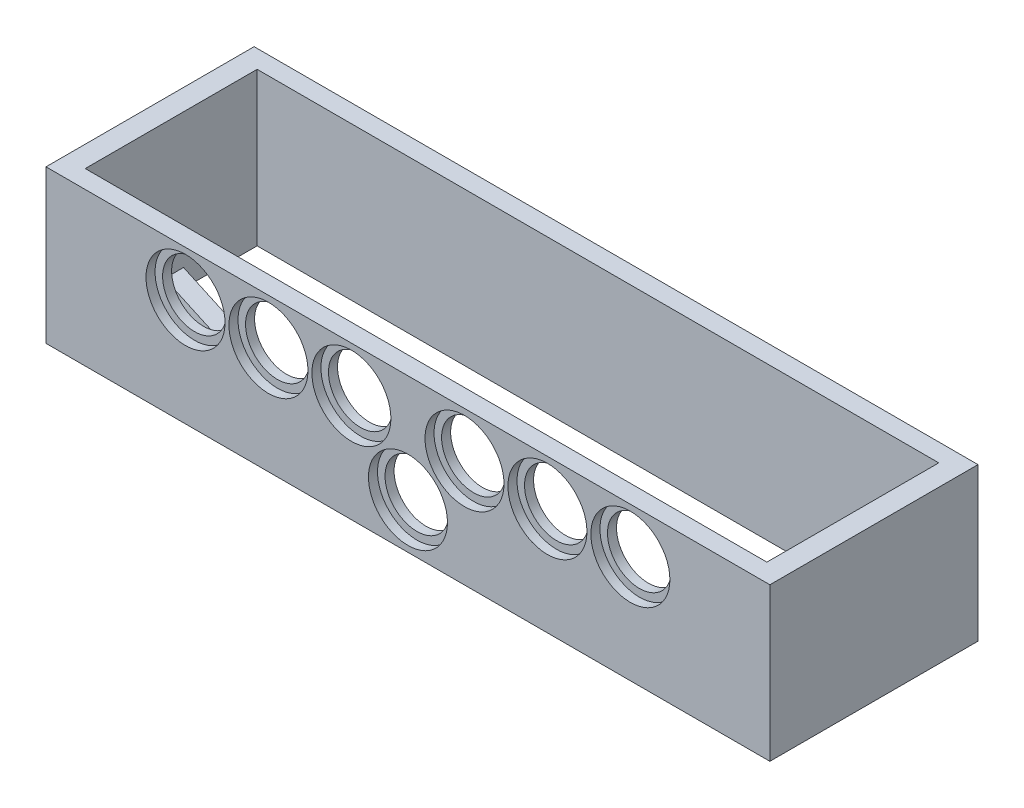
ISO-10303-21;
HEADER;
FILE_DESCRIPTION(('STEP AP214'),'2;1');
FILE_NAME('part.step','',(''),(''),'','','');
FILE_SCHEMA(('AUTOMOTIVE_DESIGN { 1 0 10303 214 1 1 1 1 }'));
ENDSEC;
DATA;
#1=APPLICATION_CONTEXT('core data for automotive mechanical design processes');
#2=APPLICATION_PROTOCOL_DEFINITION('international standard','automotive_design',2000,#1);
#3=PRODUCT_CONTEXT('',#1,'mechanical');
#4=PRODUCT('Part','Part','',(#3));
#5=PRODUCT_RELATED_PRODUCT_CATEGORY('part','',(#4));
#6=PRODUCT_DEFINITION_FORMATION('','',#4);
#7=PRODUCT_DEFINITION_CONTEXT('part definition',#1,'design');
#8=PRODUCT_DEFINITION('design','',#6,#7);
#9=PRODUCT_DEFINITION_SHAPE('','',#8);
#10=(LENGTH_UNIT() NAMED_UNIT(*) SI_UNIT(.MILLI.,.METRE.));
#11=(NAMED_UNIT(*) PLANE_ANGLE_UNIT() SI_UNIT($,.RADIAN.));
#12=(NAMED_UNIT(*) SI_UNIT($,.STERADIAN.) SOLID_ANGLE_UNIT());
#13=UNCERTAINTY_MEASURE_WITH_UNIT(LENGTH_MEASURE(1.E-05),#10,'distance_accuracy_value','');
#14=(GEOMETRIC_REPRESENTATION_CONTEXT(3) GLOBAL_UNCERTAINTY_ASSIGNED_CONTEXT((#13)) GLOBAL_UNIT_ASSIGNED_CONTEXT((#10,
#11,#12)) REPRESENTATION_CONTEXT('',''));
#15=CARTESIAN_POINT('',(0.,0.,0.));
#16=DIRECTION('',(0.,0.,1.));
#17=DIRECTION('',(1.,0.,0.));
#18=AXIS2_PLACEMENT_3D('',#15,#16,#17);
#19=CARTESIAN_POINT('',(7.00000000000001,50.7,-6.));
#20=DIRECTION('',(0.,0.,-1.));
#21=DIRECTION('',(-1.,0.,0.));
#22=AXIS2_PLACEMENT_3D('',#19,#20,#21);
#23=PLANE('',#22);
#24=CARTESIAN_POINT('',(46.25,35.6,-6.));
#25=DIRECTION('',(0.,0.,1.));
#26=DIRECTION('',(1.,0.,0.));
#27=AXIS2_PLACEMENT_3D('',#24,#25,#26);
#28=CIRCLE('',#27,10.6);
#29=CARTESIAN_POINT('',(56.85,35.6,-6.));
#30=VERTEX_POINT('',#29);
#31=EDGE_CURVE('E212',#30,#30,#28,.T.);
#32=ORIENTED_EDGE('',*,*,#31,.T.);
#33=EDGE_LOOP('',(#32));
#34=FACE_BOUND('',#33,.T.);
#35=CARTESIAN_POINT('',(101.25,35.6,-6.));
#36=DIRECTION('',(0.,0.,1.));
#37=DIRECTION('',(1.,0.,0.));
#38=AXIS2_PLACEMENT_3D('',#35,#36,#37);
#39=CIRCLE('',#38,10.6);
#40=CARTESIAN_POINT('',(111.85,35.6,-6.));
#41=VERTEX_POINT('',#40);
#42=EDGE_CURVE('E220',#41,#41,#39,.T.);
#43=ORIENTED_EDGE('',*,*,#42,.T.);
#44=EDGE_LOOP('',(#43));
#45=FACE_BOUND('',#44,.T.);
#46=CARTESIAN_POINT('',(120.,15.1,-6.));
#47=DIRECTION('',(0.,0.,1.));
#48=DIRECTION('',(1.,0.,0.));
#49=AXIS2_PLACEMENT_3D('',#46,#47,#48);
#50=CIRCLE('',#49,10.6);
#51=CARTESIAN_POINT('',(130.6,15.1,-6.));
#52=VERTEX_POINT('',#51);
#53=EDGE_CURVE('E217',#52,#52,#50,.T.);
#54=ORIENTED_EDGE('',*,*,#53,.T.);
#55=EDGE_LOOP('',(#54));
#56=FACE_BOUND('',#55,.T.);
#57=CARTESIAN_POINT('',(138.75,35.6,-6.));
#58=DIRECTION('',(0.,0.,1.));
#59=DIRECTION('',(1.,0.,0.));
#60=AXIS2_PLACEMENT_3D('',#57,#58,#59);
#61=CIRCLE('',#60,10.6);
#62=CARTESIAN_POINT('',(149.35,35.6,-6.));
#63=VERTEX_POINT('',#62);
#64=EDGE_CURVE('E224',#63,#63,#61,.T.);
#65=ORIENTED_EDGE('',*,*,#64,.T.);
#66=EDGE_LOOP('',(#65));
#67=FACE_BOUND('',#66,.T.);
#68=CARTESIAN_POINT('',(73.75,35.6,-6.));
#69=DIRECTION('',(0.,0.,1.));
#70=DIRECTION('',(1.,0.,0.));
#71=AXIS2_PLACEMENT_3D('',#68,#69,#70);
#72=CIRCLE('',#71,10.6);
#73=CARTESIAN_POINT('',(84.35,35.6,-6.));
#74=VERTEX_POINT('',#73);
#75=EDGE_CURVE('E216',#74,#74,#72,.T.);
#76=ORIENTED_EDGE('',*,*,#75,.T.);
#77=EDGE_LOOP('',(#76));
#78=FACE_BOUND('',#77,.T.);
#79=CARTESIAN_POINT('',(166.25,35.6,-6.));
#80=DIRECTION('',(0.,0.,1.));
#81=DIRECTION('',(1.,0.,0.));
#82=AXIS2_PLACEMENT_3D('',#79,#80,#81);
#83=CIRCLE('',#82,10.6);
#84=CARTESIAN_POINT('',(176.85,35.6,-6.));
#85=VERTEX_POINT('',#84);
#86=EDGE_CURVE('E221',#85,#85,#83,.T.);
#87=ORIENTED_EDGE('',*,*,#86,.T.);
#88=EDGE_LOOP('',(#87));
#89=FACE_BOUND('',#88,.T.);
#90=CARTESIAN_POINT('',(193.75,35.6,-6.));
#91=DIRECTION('',(0.,0.,1.));
#92=DIRECTION('',(1.,0.,0.));
#93=AXIS2_PLACEMENT_3D('',#90,#91,#92);
#94=CIRCLE('',#93,10.6);
#95=CARTESIAN_POINT('',(204.35,35.6,-6.));
#96=VERTEX_POINT('',#95);
#97=EDGE_CURVE('E203',#96,#96,#94,.T.);
#98=ORIENTED_EDGE('',*,*,#97,.T.);
#99=EDGE_LOOP('',(#98));
#100=FACE_BOUND('',#99,.T.);
#101=DIRECTION('',(1.,0.,0.));
#102=VECTOR('',#101,1.);
#103=CARTESIAN_POINT('',(0.,6.,-6.));
#104=LINE('',#103,#102);
#105=CARTESIAN_POINT('',(90.8695652173913,6.,-6.));
#106=VERTEX_POINT('',#105);
#107=CARTESIAN_POINT('',(110.924637681159,6.,-6.));
#108=VERTEX_POINT('',#107);
#109=EDGE_CURVE('E169',#106,#108,#104,.T.);
#110=ORIENTED_EDGE('',*,*,#109,.F.);
#111=DIRECTION('',(0.,-1.,0.));
#112=VECTOR('',#111,1.);
#113=CARTESIAN_POINT('',(90.8695652173913,6.,-6.));
#114=LINE('',#113,#112);
#115=CARTESIAN_POINT('',(90.8695652173913,0.,-6.));
#116=VERTEX_POINT('',#115);
#117=EDGE_CURVE('E182',#106,#116,#114,.T.);
#118=ORIENTED_EDGE('',*,*,#117,.T.);
#119=DIRECTION('',(1.,0.,0.));
#120=VECTOR('',#119,1.);
#121=CARTESIAN_POINT('',(7.00000000000001,0.,-6.));
#122=LINE('',#121,#120);
#123=CARTESIAN_POINT('',(7.00000000000001,0.,-6.));
#124=VERTEX_POINT('',#123);
#125=EDGE_CURVE('E293',#124,#116,#122,.T.);
#126=ORIENTED_EDGE('',*,*,#125,.F.);
#127=DIRECTION('',(0.,-1.,0.));
#128=VECTOR('',#127,1.);
#129=CARTESIAN_POINT('',(7.00000000000001,50.7,-6.));
#130=LINE('',#129,#128);
#131=CARTESIAN_POINT('',(7.00000000000001,50.7,-6.));
#132=VERTEX_POINT('',#131);
#133=EDGE_CURVE('E305',#132,#124,#130,.T.);
#134=ORIENTED_EDGE('',*,*,#133,.F.);
#135=DIRECTION('',(1.,0.,0.));
#136=VECTOR('',#135,1.);
#137=CARTESIAN_POINT('',(7.00000000000001,50.7,-6.));
#138=LINE('',#137,#136);
#139=CARTESIAN_POINT('',(233.,50.7,-6.));
#140=VERTEX_POINT('',#139);
#141=EDGE_CURVE('E281',#132,#140,#138,.T.);
#142=ORIENTED_EDGE('',*,*,#141,.T.);
#143=DIRECTION('',(0.,-1.,0.));
#144=VECTOR('',#143,1.);
#145=CARTESIAN_POINT('',(233.,50.7,-6.));
#146=LINE('',#145,#144);
#147=CARTESIAN_POINT('',(233.,0.,-6.));
#148=VERTEX_POINT('',#147);
#149=EDGE_CURVE('E302',#140,#148,#146,.T.);
#150=ORIENTED_EDGE('',*,*,#149,.T.);
#151=CARTESIAN_POINT('',(149.130434782609,0.,-6.));
#152=VERTEX_POINT('',#151);
#153=EDGE_CURVE('E292',#152,#148,#122,.T.);
#154=ORIENTED_EDGE('',*,*,#153,.F.);
#155=DIRECTION('',(0.,-1.,0.));
#156=VECTOR('',#155,1.);
#157=CARTESIAN_POINT('',(149.130434782609,6.,-6.));
#158=LINE('',#157,#156);
#159=CARTESIAN_POINT('',(149.130434782609,6.,-6.));
#160=VERTEX_POINT('',#159);
#161=EDGE_CURVE('E204',#160,#152,#158,.T.);
#162=ORIENTED_EDGE('',*,*,#161,.F.);
#163=DIRECTION('',(1.,0.,0.));
#164=VECTOR('',#163,1.);
#165=CARTESIAN_POINT('',(0.,6.,-6.));
#166=LINE('',#165,#164);
#167=CARTESIAN_POINT('',(129.075362318841,6.,-6.));
#168=VERTEX_POINT('',#167);
#169=EDGE_CURVE('E194',#168,#160,#166,.T.);
#170=ORIENTED_EDGE('',*,*,#169,.F.);
#171=DIRECTION('',(0.,-1.,0.));
#172=VECTOR('',#171,1.);
#173=CARTESIAN_POINT('',(129.075362318841,6.,-6.));
#174=LINE('',#173,#172);
#175=CARTESIAN_POINT('',(129.075362318841,0.,-6.));
#176=VERTEX_POINT('',#175);
#177=EDGE_CURVE('E200',#168,#176,#174,.T.);
#178=ORIENTED_EDGE('',*,*,#177,.T.);
#179=CARTESIAN_POINT('',(110.924637681159,0.,-6.));
#180=VERTEX_POINT('',#179);
#181=EDGE_CURVE('E297',#180,#176,#122,.T.);
#182=ORIENTED_EDGE('',*,*,#181,.F.);
#183=DIRECTION('',(0.,-1.,0.));
#184=VECTOR('',#183,1.);
#185=CARTESIAN_POINT('',(110.924637681159,6.,-6.));
#186=LINE('',#185,#184);
#187=EDGE_CURVE('E161',#108,#180,#186,.T.);
#188=ORIENTED_EDGE('',*,*,#187,.F.);
#189=EDGE_LOOP('',(#110,#118,#126,#134,#142,#150,#154,#162,#170,#178,#182,#188));
#190=FACE_BOUND('',#189,.T.);
#191=ADVANCED_FACE('F39',(#34,#45,#56,#67,#78,#89,#100,#190),#23,.T.);
#192=CARTESIAN_POINT('',(7.00000000000001,50.7,-63.));
#193=DIRECTION('',(1.,0.,0.));
#194=DIRECTION('',(0.,0.,-1.));
#195=AXIS2_PLACEMENT_3D('',#192,#193,#194);
#196=PLANE('',#195);
#197=DIRECTION('',(0.,0.,1.));
#198=VECTOR('',#197,1.);
#199=CARTESIAN_POINT('',(7.00000000000001,0.,-63.));
#200=LINE('',#199,#198);
#201=CARTESIAN_POINT('',(7.00000000000001,0.,-32.3045454545455));
#202=VERTEX_POINT('',#201);
#203=EDGE_CURVE('E289',#202,#124,#200,.T.);
#204=ORIENTED_EDGE('',*,*,#203,.F.);
#205=DIRECTION('',(0.,-1.,0.));
#206=VECTOR('',#205,1.);
#207=CARTESIAN_POINT('',(7.00000000000001,6.,-32.3045454545455));
#208=LINE('',#207,#206);
#209=CARTESIAN_POINT('',(7.00000000000001,6.,-32.3045454545455));
#210=VERTEX_POINT('',#209);
#211=EDGE_CURVE('E64',#210,#202,#208,.T.);
#212=ORIENTED_EDGE('',*,*,#211,.F.);
#213=DIRECTION('',(0.,0.,1.));
#214=VECTOR('',#213,1.);
#215=CARTESIAN_POINT('',(7.00000000000001,6.,0.));
#216=LINE('',#215,#214);
#217=CARTESIAN_POINT('',(7.00000000000001,6.,-38.5945454545455));
#218=VERTEX_POINT('',#217);
#219=EDGE_CURVE('E167',#218,#210,#216,.T.);
#220=ORIENTED_EDGE('',*,*,#219,.F.);
#221=DIRECTION('',(0.,-1.,0.));
#222=VECTOR('',#221,1.);
#223=CARTESIAN_POINT('',(7.00000000000001,6.,-38.5945454545455));
#224=LINE('',#223,#222);
#225=CARTESIAN_POINT('',(7.00000000000001,0.,-38.5945454545455));
#226=VERTEX_POINT('',#225);
#227=EDGE_CURVE('E154',#218,#226,#224,.T.);
#228=ORIENTED_EDGE('',*,*,#227,.T.);
#229=CARTESIAN_POINT('',(7.00000000000001,0.,-63.));
#230=VERTEX_POINT('',#229);
#231=EDGE_CURVE('E290',#230,#226,#200,.T.);
#232=ORIENTED_EDGE('',*,*,#231,.F.);
#233=DIRECTION('',(0.,-1.,0.));
#234=VECTOR('',#233,1.);
#235=CARTESIAN_POINT('',(7.00000000000001,50.7,-63.));
#236=LINE('',#235,#234);
#237=CARTESIAN_POINT('',(7.00000000000001,50.7,-63.));
#238=VERTEX_POINT('',#237);
#239=EDGE_CURVE('E308',#238,#230,#236,.T.);
#240=ORIENTED_EDGE('',*,*,#239,.F.);
#241=DIRECTION('',(0.,0.,1.));
#242=VECTOR('',#241,1.);
#243=CARTESIAN_POINT('',(7.00000000000001,50.7,-63.));
#244=LINE('',#243,#242);
#245=EDGE_CURVE('E278',#238,#132,#244,.T.);
#246=ORIENTED_EDGE('',*,*,#245,.T.);
#247=ORIENTED_EDGE('',*,*,#133,.T.);
#248=EDGE_LOOP('',(#204,#212,#220,#228,#232,#240,#246,#247));
#249=FACE_BOUND('',#248,.T.);
#250=ADVANCED_FACE('F172',(#249),#196,.T.);
#251=CARTESIAN_POINT('',(233.,50.7,-6.));
#252=DIRECTION('',(-1.,0.,0.));
#253=DIRECTION('',(0.,0.,1.));
#254=AXIS2_PLACEMENT_3D('',#251,#252,#253);
#255=PLANE('',#254);
#256=DIRECTION('',(0.,0.,-1.));
#257=VECTOR('',#256,1.);
#258=CARTESIAN_POINT('',(233.,0.,-6.));
#259=LINE('',#258,#257);
#260=CARTESIAN_POINT('',(233.,0.,-38.5945454545455));
#261=VERTEX_POINT('',#260);
#262=CARTESIAN_POINT('',(233.,0.,-63.));
#263=VERTEX_POINT('',#262);
#264=EDGE_CURVE('E296',#261,#263,#259,.T.);
#265=ORIENTED_EDGE('',*,*,#264,.F.);
#266=DIRECTION('',(0.,-1.,0.));
#267=VECTOR('',#266,1.);
#268=CARTESIAN_POINT('',(233.,6.,-38.5945454545455));
#269=LINE('',#268,#267);
#270=CARTESIAN_POINT('',(233.,6.,-38.5945454545455));
#271=VERTEX_POINT('',#270);
#272=EDGE_CURVE('E196',#271,#261,#269,.T.);
#273=ORIENTED_EDGE('',*,*,#272,.F.);
#274=DIRECTION('',(0.,0.,-1.));
#275=VECTOR('',#274,1.);
#276=CARTESIAN_POINT('',(233.,6.,0.));
#277=LINE('',#276,#275);
#278=CARTESIAN_POINT('',(233.,6.,-32.3045454545455));
#279=VERTEX_POINT('',#278);
#280=EDGE_CURVE('E188',#279,#271,#277,.T.);
#281=ORIENTED_EDGE('',*,*,#280,.F.);
#282=DIRECTION('',(0.,-1.,0.));
#283=VECTOR('',#282,1.);
#284=CARTESIAN_POINT('',(233.,6.,-32.3045454545455));
#285=LINE('',#284,#283);
#286=CARTESIAN_POINT('',(233.,0.,-32.3045454545455));
#287=VERTEX_POINT('',#286);
#288=EDGE_CURVE('E207',#279,#287,#285,.T.);
#289=ORIENTED_EDGE('',*,*,#288,.T.);
#290=EDGE_CURVE('E279',#148,#287,#259,.T.);
#291=ORIENTED_EDGE('',*,*,#290,.F.);
#292=ORIENTED_EDGE('',*,*,#149,.F.);
#293=DIRECTION('',(0.,0.,-1.));
#294=VECTOR('',#293,1.);
#295=CARTESIAN_POINT('',(233.,50.7,-6.));
#296=LINE('',#295,#294);
#297=CARTESIAN_POINT('',(233.,50.7,-63.));
#298=VERTEX_POINT('',#297);
#299=EDGE_CURVE('E284',#140,#298,#296,.T.);
#300=ORIENTED_EDGE('',*,*,#299,.T.);
#301=DIRECTION('',(0.,-1.,0.));
#302=VECTOR('',#301,1.);
#303=CARTESIAN_POINT('',(233.,50.7,-63.));
#304=LINE('',#303,#302);
#305=EDGE_CURVE('E286',#298,#263,#304,.T.);
#306=ORIENTED_EDGE('',*,*,#305,.T.);
#307=EDGE_LOOP('',(#265,#273,#281,#289,#291,#292,#300,#306));
#308=FACE_BOUND('',#307,.T.);
#309=ADVANCED_FACE('F400',(#308),#255,.T.);
#310=CARTESIAN_POINT('',(0.,50.7,0.));
#311=DIRECTION('',(0.,1.,0.));
#312=DIRECTION('',(0.,0.,1.));
#313=AXIS2_PLACEMENT_3D('',#310,#311,#312);
#314=PLANE('',#313);
#315=DIRECTION('',(0.,0.,1.));
#316=VECTOR('',#315,1.);
#317=CARTESIAN_POINT('',(0.,50.7,-69.));
#318=LINE('',#317,#316);
#319=CARTESIAN_POINT('',(0.,50.7,-69.));
#320=VERTEX_POINT('',#319);
#321=CARTESIAN_POINT('',(0.,50.7,0.));
#322=VERTEX_POINT('',#321);
#323=EDGE_CURVE('E312',#320,#322,#318,.T.);
#324=ORIENTED_EDGE('',*,*,#323,.T.);
#325=DIRECTION('',(1.,0.,0.));
#326=VECTOR('',#325,1.);
#327=CARTESIAN_POINT('',(0.,50.7,0.));
#328=LINE('',#327,#326);
#329=CARTESIAN_POINT('',(240.,50.7,0.));
#330=VERTEX_POINT('',#329);
#331=EDGE_CURVE('E315',#322,#330,#328,.T.);
#332=ORIENTED_EDGE('',*,*,#331,.T.);
#333=DIRECTION('',(0.,0.,-1.));
#334=VECTOR('',#333,1.);
#335=CARTESIAN_POINT('',(240.,50.7,0.));
#336=LINE('',#335,#334);
#337=CARTESIAN_POINT('',(240.,50.7,-69.));
#338=VERTEX_POINT('',#337);
#339=EDGE_CURVE('E318',#330,#338,#336,.T.);
#340=ORIENTED_EDGE('',*,*,#339,.T.);
#341=DIRECTION('',(-1.,0.,0.));
#342=VECTOR('',#341,1.);
#343=CARTESIAN_POINT('',(240.,50.7,-69.));
#344=LINE('',#343,#342);
#345=EDGE_CURVE('E320',#338,#320,#344,.T.);
#346=ORIENTED_EDGE('',*,*,#345,.T.);
#347=EDGE_LOOP('',(#324,#332,#340,#346));
#348=FACE_BOUND('',#347,.T.);
#349=ORIENTED_EDGE('',*,*,#245,.F.);
#350=DIRECTION('',(-1.,0.,0.));
#351=VECTOR('',#350,1.);
#352=CARTESIAN_POINT('',(233.,50.7,-63.));
#353=LINE('',#352,#351);
#354=EDGE_CURVE('E276',#298,#238,#353,.T.);
#355=ORIENTED_EDGE('',*,*,#354,.F.);
#356=ORIENTED_EDGE('',*,*,#299,.F.);
#357=ORIENTED_EDGE('',*,*,#141,.F.);
#358=EDGE_LOOP('',(#349,#355,#356,#357));
#359=FACE_BOUND('',#358,.T.);
#360=ADVANCED_FACE('F397',(#348,#359),#314,.T.);
#361=CARTESIAN_POINT('',(0.,0.,0.));
#362=DIRECTION('',(0.,1.,0.));
#363=DIRECTION('',(0.,0.,1.));
#364=AXIS2_PLACEMENT_3D('',#361,#362,#363);
#365=PLANE('',#364);
#366=DIRECTION('',(0.954170773644413,0.,0.299262651733929));
#367=VECTOR('',#366,1.);
#368=CARTESIAN_POINT('',(11.6474897010967,0.,-37.136923684656));
#369=LINE('',#368,#367);
#370=EDGE_CURVE('E56',#226,#180,#369,.T.);
#371=ORIENTED_EDGE('',*,*,#370,.T.);
#372=ORIENTED_EDGE('',*,*,#181,.T.);
#373=DIRECTION('',(-0.954170773644413,0.,0.29926265173393));
#374=VECTOR('',#373,1.);
#375=CARTESIAN_POINT('',(9.8464626323809,0.,31.394518538026));
#376=LINE('',#375,#374);
#377=EDGE_CURVE('E181',#261,#176,#376,.T.);
#378=ORIENTED_EDGE('',*,*,#377,.F.);
#379=ORIENTED_EDGE('',*,*,#264,.T.);
#380=DIRECTION('',(-1.,0.,0.));
#381=VECTOR('',#380,1.);
#382=CARTESIAN_POINT('',(233.,0.,-63.));
#383=LINE('',#382,#381);
#384=EDGE_CURVE('E236',#263,#230,#383,.T.);
#385=ORIENTED_EDGE('',*,*,#384,.T.);
#386=ORIENTED_EDGE('',*,*,#231,.T.);
#387=EDGE_LOOP('',(#371,#372,#378,#379,#385,#386));
#388=FACE_BOUND('',#387,.T.);
#389=DIRECTION('',(-0.954170773644413,0.,0.29926265173393));
#390=VECTOR('',#389,1.);
#391=CARTESIAN_POINT('',(11.642557513967,0.,37.1211978706195));
#392=LINE('',#391,#390);
#393=EDGE_CURVE('E189',#287,#152,#392,.T.);
#394=ORIENTED_EDGE('',*,*,#393,.T.);
#395=ORIENTED_EDGE('',*,*,#153,.T.);
#396=ORIENTED_EDGE('',*,*,#290,.T.);
#397=EDGE_LOOP('',(#394,#395,#396));
#398=FACE_BOUND('',#397,.T.);
#399=DIRECTION('',(0.,0.,1.));
#400=VECTOR('',#399,1.);
#401=CARTESIAN_POINT('',(0.,0.,-69.));
#402=LINE('',#401,#400);
#403=CARTESIAN_POINT('',(0.,0.,-69.));
#404=VERTEX_POINT('',#403);
#405=CARTESIAN_POINT('',(0.,0.,0.));
#406=VERTEX_POINT('',#405);
#407=EDGE_CURVE('E311',#404,#406,#402,.T.);
#408=ORIENTED_EDGE('',*,*,#407,.F.);
#409=DIRECTION('',(-1.,0.,0.));
#410=VECTOR('',#409,1.);
#411=CARTESIAN_POINT('',(240.,0.,-69.));
#412=LINE('',#411,#410);
#413=CARTESIAN_POINT('',(240.,0.,-69.));
#414=VERTEX_POINT('',#413);
#415=EDGE_CURVE('E316',#414,#404,#412,.T.);
#416=ORIENTED_EDGE('',*,*,#415,.F.);
#417=DIRECTION('',(0.,0.,-1.));
#418=VECTOR('',#417,1.);
#419=CARTESIAN_POINT('',(240.,0.,0.));
#420=LINE('',#419,#418);
#421=CARTESIAN_POINT('',(240.,0.,0.));
#422=VERTEX_POINT('',#421);
#423=EDGE_CURVE('E327',#422,#414,#420,.T.);
#424=ORIENTED_EDGE('',*,*,#423,.F.);
#425=DIRECTION('',(1.,0.,0.));
#426=VECTOR('',#425,1.);
#427=CARTESIAN_POINT('',(0.,0.,0.));
#428=LINE('',#427,#426);
#429=EDGE_CURVE('E325',#406,#422,#428,.T.);
#430=ORIENTED_EDGE('',*,*,#429,.F.);
#431=EDGE_LOOP('',(#408,#416,#424,#430));
#432=FACE_BOUND('',#431,.T.);
#433=ORIENTED_EDGE('',*,*,#125,.T.);
#434=DIRECTION('',(0.954170773644413,0.,0.299262651733929));
#435=VECTOR('',#434,1.);
#436=CARTESIAN_POINT('',(9.85139481951055,0.,-31.4102443520626));
#437=LINE('',#436,#435);
#438=EDGE_CURVE('E173',#202,#116,#437,.T.);
#439=ORIENTED_EDGE('',*,*,#438,.F.);
#440=ORIENTED_EDGE('',*,*,#203,.T.);
#441=EDGE_LOOP('',(#433,#439,#440));
#442=FACE_BOUND('',#441,.T.);
#443=ADVANCED_FACE('F388',(#388,#398,#432,#442),#365,.F.);
#444=CARTESIAN_POINT('',(0.,50.7,-69.));
#445=DIRECTION('',(1.,0.,0.));
#446=DIRECTION('',(0.,0.,-1.));
#447=AXIS2_PLACEMENT_3D('',#444,#445,#446);
#448=PLANE('',#447);
#449=ORIENTED_EDGE('',*,*,#407,.T.);
#450=DIRECTION('',(0.,-1.,0.));
#451=VECTOR('',#450,1.);
#452=CARTESIAN_POINT('',(0.,50.7,0.));
#453=LINE('',#452,#451);
#454=EDGE_CURVE('E11',#322,#406,#453,.T.);
#455=ORIENTED_EDGE('',*,*,#454,.F.);
#456=ORIENTED_EDGE('',*,*,#323,.F.);
#457=DIRECTION('',(0.,-1.,0.));
#458=VECTOR('',#457,1.);
#459=CARTESIAN_POINT('',(0.,50.7,-69.));
#460=LINE('',#459,#458);
#461=EDGE_CURVE('E322',#320,#404,#460,.T.);
#462=ORIENTED_EDGE('',*,*,#461,.T.);
#463=EDGE_LOOP('',(#449,#455,#456,#462));
#464=FACE_BOUND('',#463,.T.);
#465=ADVANCED_FACE('F41',(#464),#448,.F.);
#466=CARTESIAN_POINT('',(0.,50.7,0.));
#467=DIRECTION('',(0.,0.,-1.));
#468=DIRECTION('',(-1.,0.,0.));
#469=AXIS2_PLACEMENT_3D('',#466,#467,#468);
#470=PLANE('',#469);
#471=CARTESIAN_POINT('',(46.25,35.6,0.));
#472=DIRECTION('',(0.,0.,1.));
#473=DIRECTION('',(1.,0.,0.));
#474=AXIS2_PLACEMENT_3D('',#471,#472,#473);
#475=CIRCLE('',#474,13.1);
#476=CARTESIAN_POINT('',(59.35,35.6,0.));
#477=VERTEX_POINT('',#476);
#478=EDGE_CURVE('E237',#477,#477,#475,.T.);
#479=ORIENTED_EDGE('',*,*,#478,.F.);
#480=EDGE_LOOP('',(#479));
#481=FACE_BOUND('',#480,.T.);
#482=CARTESIAN_POINT('',(120.,15.1,0.));
#483=DIRECTION('',(0.,0.,1.));
#484=DIRECTION('',(1.,0.,0.));
#485=AXIS2_PLACEMENT_3D('',#482,#483,#484);
#486=CIRCLE('',#485,13.1);
#487=CARTESIAN_POINT('',(133.1,15.1,0.));
#488=VERTEX_POINT('',#487);
#489=EDGE_CURVE('E251',#488,#488,#486,.T.);
#490=ORIENTED_EDGE('',*,*,#489,.F.);
#491=EDGE_LOOP('',(#490));
#492=FACE_BOUND('',#491,.T.);
#493=CARTESIAN_POINT('',(193.75,35.6,0.));
#494=DIRECTION('',(0.,0.,1.));
#495=DIRECTION('',(1.,0.,0.));
#496=AXIS2_PLACEMENT_3D('',#493,#494,#495);
#497=CIRCLE('',#496,13.1);
#498=CARTESIAN_POINT('',(206.85,35.6,0.));
#499=VERTEX_POINT('',#498);
#500=EDGE_CURVE('E245',#499,#499,#497,.T.);
#501=ORIENTED_EDGE('',*,*,#500,.F.);
#502=EDGE_LOOP('',(#501));
#503=FACE_BOUND('',#502,.T.);
#504=CARTESIAN_POINT('',(166.25,35.6,0.));
#505=DIRECTION('',(0.,0.,1.));
#506=DIRECTION('',(1.,0.,0.));
#507=AXIS2_PLACEMENT_3D('',#504,#505,#506);
#508=CIRCLE('',#507,13.1);
#509=CARTESIAN_POINT('',(179.35,35.6,0.));
#510=VERTEX_POINT('',#509);
#511=EDGE_CURVE('E244',#510,#510,#508,.T.);
#512=ORIENTED_EDGE('',*,*,#511,.F.);
#513=EDGE_LOOP('',(#512));
#514=FACE_BOUND('',#513,.T.);
#515=CARTESIAN_POINT('',(138.75,35.6,0.));
#516=DIRECTION('',(0.,0.,1.));
#517=DIRECTION('',(1.,0.,0.));
#518=AXIS2_PLACEMENT_3D('',#515,#516,#517);
#519=CIRCLE('',#518,13.1);
#520=CARTESIAN_POINT('',(151.85,35.6,0.));
#521=VERTEX_POINT('',#520);
#522=EDGE_CURVE('E268',#521,#521,#519,.T.);
#523=ORIENTED_EDGE('',*,*,#522,.F.);
#524=EDGE_LOOP('',(#523));
#525=FACE_BOUND('',#524,.T.);
#526=CARTESIAN_POINT('',(101.25,35.6,0.));
#527=DIRECTION('',(0.,0.,1.));
#528=DIRECTION('',(1.,0.,0.));
#529=AXIS2_PLACEMENT_3D('',#526,#527,#528);
#530=CIRCLE('',#529,13.1);
#531=CARTESIAN_POINT('',(114.35,35.6,0.));
#532=VERTEX_POINT('',#531);
#533=EDGE_CURVE('E262',#532,#532,#530,.T.);
#534=ORIENTED_EDGE('',*,*,#533,.F.);
#535=EDGE_LOOP('',(#534));
#536=FACE_BOUND('',#535,.T.);
#537=CARTESIAN_POINT('',(73.75,35.6,0.));
#538=DIRECTION('',(0.,0.,1.));
#539=DIRECTION('',(1.,0.,0.));
#540=AXIS2_PLACEMENT_3D('',#537,#538,#539);
#541=CIRCLE('',#540,13.1);
#542=CARTESIAN_POINT('',(86.85,35.6,0.));
#543=VERTEX_POINT('',#542);
#544=EDGE_CURVE('E256',#543,#543,#541,.T.);
#545=ORIENTED_EDGE('',*,*,#544,.F.);
#546=EDGE_LOOP('',(#545));
#547=FACE_BOUND('',#546,.T.);
#548=ORIENTED_EDGE('',*,*,#429,.T.);
#549=DIRECTION('',(0.,-1.,0.));
#550=VECTOR('',#549,1.);
#551=CARTESIAN_POINT('',(240.,50.7,0.));
#552=LINE('',#551,#550);
#553=EDGE_CURVE('E48',#330,#422,#552,.T.);
#554=ORIENTED_EDGE('',*,*,#553,.F.);
#555=ORIENTED_EDGE('',*,*,#331,.F.);
#556=ORIENTED_EDGE('',*,*,#454,.T.);
#557=EDGE_LOOP('',(#548,#554,#555,#556));
#558=FACE_BOUND('',#557,.T.);
#559=ADVANCED_FACE('F374',(#481,#492,#503,#514,#525,#536,#547,#558),#470,.F.);
#560=CARTESIAN_POINT('',(240.,50.7,0.));
#561=DIRECTION('',(-1.,0.,0.));
#562=DIRECTION('',(0.,0.,1.));
#563=AXIS2_PLACEMENT_3D('',#560,#561,#562);
#564=PLANE('',#563);
#565=ORIENTED_EDGE('',*,*,#423,.T.);
#566=DIRECTION('',(0.,-1.,0.));
#567=VECTOR('',#566,1.);
#568=CARTESIAN_POINT('',(240.,50.7,-69.));
#569=LINE('',#568,#567);
#570=EDGE_CURVE('E332',#338,#414,#569,.T.);
#571=ORIENTED_EDGE('',*,*,#570,.F.);
#572=ORIENTED_EDGE('',*,*,#339,.F.);
#573=ORIENTED_EDGE('',*,*,#553,.T.);
#574=EDGE_LOOP('',(#565,#571,#572,#573));
#575=FACE_BOUND('',#574,.T.);
#576=ADVANCED_FACE('F377',(#575),#564,.F.);
#577=CARTESIAN_POINT('',(240.,50.7,-69.));
#578=DIRECTION('',(0.,0.,1.));
#579=DIRECTION('',(1.,0.,0.));
#580=AXIS2_PLACEMENT_3D('',#577,#578,#579);
#581=PLANE('',#580);
#582=ORIENTED_EDGE('',*,*,#415,.T.);
#583=ORIENTED_EDGE('',*,*,#461,.F.);
#584=ORIENTED_EDGE('',*,*,#345,.F.);
#585=ORIENTED_EDGE('',*,*,#570,.T.);
#586=EDGE_LOOP('',(#582,#583,#584,#585));
#587=FACE_BOUND('',#586,.T.);
#588=ADVANCED_FACE('F392',(#587),#581,.F.);
#589=CARTESIAN_POINT('',(233.,50.7,-63.));
#590=DIRECTION('',(0.,0.,1.));
#591=DIRECTION('',(1.,0.,0.));
#592=AXIS2_PLACEMENT_3D('',#589,#590,#591);
#593=PLANE('',#592);
#594=ORIENTED_EDGE('',*,*,#384,.F.);
#595=ORIENTED_EDGE('',*,*,#305,.F.);
#596=ORIENTED_EDGE('',*,*,#354,.T.);
#597=ORIENTED_EDGE('',*,*,#239,.T.);
#598=EDGE_LOOP('',(#594,#595,#596,#597));
#599=FACE_BOUND('',#598,.T.);
#600=ADVANCED_FACE('F370',(#599),#593,.T.);
#601=CARTESIAN_POINT('',(73.75,35.6,-3.));
#602=DIRECTION('',(0.,0.,1.));
#603=DIRECTION('',(1.,0.,0.));
#604=AXIS2_PLACEMENT_3D('',#601,#602,#603);
#605=CYLINDRICAL_SURFACE('',#604,13.1);
#606=CARTESIAN_POINT('',(73.75,35.6,-3.));
#607=DIRECTION('',(0.,0.,1.));
#608=DIRECTION('',(1.,0.,0.));
#609=AXIS2_PLACEMENT_3D('',#606,#607,#608);
#610=CIRCLE('',#609,13.1);
#611=CARTESIAN_POINT('',(86.85,35.6,-3.));
#612=VERTEX_POINT('',#611);
#613=EDGE_CURVE('E240',#612,#612,#610,.T.);
#614=ORIENTED_EDGE('',*,*,#613,.F.);
#615=EDGE_LOOP('',(#614));
#616=FACE_BOUND('',#615,.T.);
#617=ORIENTED_EDGE('',*,*,#544,.T.);
#618=EDGE_LOOP('',(#617));
#619=FACE_BOUND('',#618,.T.);
#620=ADVANCED_FACE('F364',(#616,#619),#605,.F.);
#621=CARTESIAN_POINT('',(73.75,35.6,-3.));
#622=DIRECTION('',(0.,0.,1.));
#623=DIRECTION('',(1.,0.,0.));
#624=AXIS2_PLACEMENT_3D('',#621,#622,#623);
#625=PLANE('',#624);
#626=CARTESIAN_POINT('',(73.75,35.6,-3.));
#627=DIRECTION('',(0.,0.,1.));
#628=DIRECTION('',(1.,0.,0.));
#629=AXIS2_PLACEMENT_3D('',#626,#627,#628);
#630=CIRCLE('',#629,10.6);
#631=CARTESIAN_POINT('',(84.35,35.6,-3.));
#632=VERTEX_POINT('',#631);
#633=EDGE_CURVE('E43',#632,#632,#630,.T.);
#634=ORIENTED_EDGE('',*,*,#633,.F.);
#635=EDGE_LOOP('',(#634));
#636=FACE_BOUND('',#635,.T.);
#637=ORIENTED_EDGE('',*,*,#613,.T.);
#638=EDGE_LOOP('',(#637));
#639=FACE_BOUND('',#638,.T.);
#640=ADVANCED_FACE('F360',(#636,#639),#625,.T.);
#641=CARTESIAN_POINT('',(101.25,35.6,-3.));
#642=DIRECTION('',(0.,0.,1.));
#643=DIRECTION('',(1.,0.,0.));
#644=AXIS2_PLACEMENT_3D('',#641,#642,#643);
#645=CYLINDRICAL_SURFACE('',#644,13.1);
#646=CARTESIAN_POINT('',(101.25,35.6,-3.));
#647=DIRECTION('',(0.,0.,1.));
#648=DIRECTION('',(1.,0.,0.));
#649=AXIS2_PLACEMENT_3D('',#646,#647,#648);
#650=CIRCLE('',#649,13.1);
#651=CARTESIAN_POINT('',(114.35,35.6,-3.));
#652=VERTEX_POINT('',#651);
#653=EDGE_CURVE('E259',#652,#652,#650,.T.);
#654=ORIENTED_EDGE('',*,*,#653,.F.);
#655=EDGE_LOOP('',(#654));
#656=FACE_BOUND('',#655,.T.);
#657=ORIENTED_EDGE('',*,*,#533,.T.);
#658=EDGE_LOOP('',(#657));
#659=FACE_BOUND('',#658,.T.);
#660=ADVANCED_FACE('F363',(#656,#659),#645,.F.);
#661=CARTESIAN_POINT('',(101.25,35.6,-3.));
#662=DIRECTION('',(0.,0.,1.));
#663=DIRECTION('',(1.,0.,0.));
#664=AXIS2_PLACEMENT_3D('',#661,#662,#663);
#665=PLANE('',#664);
#666=CARTESIAN_POINT('',(101.25,35.6,-3.));
#667=DIRECTION('',(0.,0.,1.));
#668=DIRECTION('',(1.,0.,0.));
#669=AXIS2_PLACEMENT_3D('',#666,#667,#668);
#670=CIRCLE('',#669,10.6);
#671=CARTESIAN_POINT('',(111.85,35.6,-3.));
#672=VERTEX_POINT('',#671);
#673=EDGE_CURVE('E350',#672,#672,#670,.T.);
#674=ORIENTED_EDGE('',*,*,#673,.F.);
#675=EDGE_LOOP('',(#674));
#676=FACE_BOUND('',#675,.T.);
#677=ORIENTED_EDGE('',*,*,#653,.T.);
#678=EDGE_LOOP('',(#677));
#679=FACE_BOUND('',#678,.T.);
#680=ADVANCED_FACE('F464',(#676,#679),#665,.T.);
#681=CARTESIAN_POINT('',(138.75,35.6,-3.));
#682=DIRECTION('',(0.,0.,1.));
#683=DIRECTION('',(1.,0.,0.));
#684=AXIS2_PLACEMENT_3D('',#681,#682,#683);
#685=CYLINDRICAL_SURFACE('',#684,13.1);
#686=CARTESIAN_POINT('',(138.75,35.6,-3.));
#687=DIRECTION('',(0.,0.,1.));
#688=DIRECTION('',(1.,0.,0.));
#689=AXIS2_PLACEMENT_3D('',#686,#687,#688);
#690=CIRCLE('',#689,13.1);
#691=CARTESIAN_POINT('',(151.85,35.6,-3.));
#692=VERTEX_POINT('',#691);
#693=EDGE_CURVE('E265',#692,#692,#690,.T.);
#694=ORIENTED_EDGE('',*,*,#693,.F.);
#695=EDGE_LOOP('',(#694));
#696=FACE_BOUND('',#695,.T.);
#697=ORIENTED_EDGE('',*,*,#522,.T.);
#698=EDGE_LOOP('',(#697));
#699=FACE_BOUND('',#698,.T.);
#700=ADVANCED_FACE('F461',(#696,#699),#685,.F.);
#701=CARTESIAN_POINT('',(138.75,35.6,-3.));
#702=DIRECTION('',(0.,0.,1.));
#703=DIRECTION('',(1.,0.,0.));
#704=AXIS2_PLACEMENT_3D('',#701,#702,#703);
#705=PLANE('',#704);
#706=CARTESIAN_POINT('',(138.75,35.6,-3.));
#707=DIRECTION('',(0.,0.,1.));
#708=DIRECTION('',(1.,0.,0.));
#709=AXIS2_PLACEMENT_3D('',#706,#707,#708);
#710=CIRCLE('',#709,10.6);
#711=CARTESIAN_POINT('',(149.35,35.6,-3.));
#712=VERTEX_POINT('',#711);
#713=EDGE_CURVE('E348',#712,#712,#710,.T.);
#714=ORIENTED_EDGE('',*,*,#713,.F.);
#715=EDGE_LOOP('',(#714));
#716=FACE_BOUND('',#715,.T.);
#717=ORIENTED_EDGE('',*,*,#693,.T.);
#718=EDGE_LOOP('',(#717));
#719=FACE_BOUND('',#718,.T.);
#720=ADVANCED_FACE('F455',(#716,#719),#705,.T.);
#721=CARTESIAN_POINT('',(166.25,35.6,-3.));
#722=DIRECTION('',(0.,0.,1.));
#723=DIRECTION('',(1.,0.,0.));
#724=AXIS2_PLACEMENT_3D('',#721,#722,#723);
#725=CYLINDRICAL_SURFACE('',#724,13.1);
#726=CARTESIAN_POINT('',(166.25,35.6,-3.));
#727=DIRECTION('',(0.,0.,1.));
#728=DIRECTION('',(1.,0.,0.));
#729=AXIS2_PLACEMENT_3D('',#726,#727,#728);
#730=CIRCLE('',#729,13.1);
#731=CARTESIAN_POINT('',(179.35,35.6,-3.));
#732=VERTEX_POINT('',#731);
#733=EDGE_CURVE('E271',#732,#732,#730,.T.);
#734=ORIENTED_EDGE('',*,*,#733,.F.);
#735=EDGE_LOOP('',(#734));
#736=FACE_BOUND('',#735,.T.);
#737=ORIENTED_EDGE('',*,*,#511,.T.);
#738=EDGE_LOOP('',(#737));
#739=FACE_BOUND('',#738,.T.);
#740=ADVANCED_FACE('F451',(#736,#739),#725,.F.);
#741=CARTESIAN_POINT('',(166.25,35.6,-3.));
#742=DIRECTION('',(0.,0.,1.));
#743=DIRECTION('',(1.,0.,0.));
#744=AXIS2_PLACEMENT_3D('',#741,#742,#743);
#745=PLANE('',#744);
#746=CARTESIAN_POINT('',(166.25,35.6,-3.));
#747=DIRECTION('',(0.,0.,1.));
#748=DIRECTION('',(1.,0.,0.));
#749=AXIS2_PLACEMENT_3D('',#746,#747,#748);
#750=CIRCLE('',#749,10.6);
#751=CARTESIAN_POINT('',(176.85,35.6,-3.));
#752=VERTEX_POINT('',#751);
#753=EDGE_CURVE('E345',#752,#752,#750,.T.);
#754=ORIENTED_EDGE('',*,*,#753,.F.);
#755=EDGE_LOOP('',(#754));
#756=FACE_BOUND('',#755,.T.);
#757=ORIENTED_EDGE('',*,*,#733,.T.);
#758=EDGE_LOOP('',(#757));
#759=FACE_BOUND('',#758,.T.);
#760=ADVANCED_FACE('F454',(#756,#759),#745,.T.);
#761=CARTESIAN_POINT('',(193.75,35.6,-3.));
#762=DIRECTION('',(0.,0.,1.));
#763=DIRECTION('',(1.,0.,0.));
#764=AXIS2_PLACEMENT_3D('',#761,#762,#763);
#765=CYLINDRICAL_SURFACE('',#764,13.1);
#766=CARTESIAN_POINT('',(193.75,35.6,-3.));
#767=DIRECTION('',(0.,0.,1.));
#768=DIRECTION('',(1.,0.,0.));
#769=AXIS2_PLACEMENT_3D('',#766,#767,#768);
#770=CIRCLE('',#769,13.1);
#771=CARTESIAN_POINT('',(206.85,35.6,-3.));
#772=VERTEX_POINT('',#771);
#773=EDGE_CURVE('E241',#772,#772,#770,.T.);
#774=ORIENTED_EDGE('',*,*,#773,.F.);
#775=EDGE_LOOP('',(#774));
#776=FACE_BOUND('',#775,.T.);
#777=ORIENTED_EDGE('',*,*,#500,.T.);
#778=EDGE_LOOP('',(#777));
#779=FACE_BOUND('',#778,.T.);
#780=ADVANCED_FACE('F459',(#776,#779),#765,.F.);
#781=CARTESIAN_POINT('',(193.75,35.6,-3.));
#782=DIRECTION('',(0.,0.,1.));
#783=DIRECTION('',(1.,0.,0.));
#784=AXIS2_PLACEMENT_3D('',#781,#782,#783);
#785=PLANE('',#784);
#786=CARTESIAN_POINT('',(193.75,35.6,-3.));
#787=DIRECTION('',(0.,0.,1.));
#788=DIRECTION('',(1.,0.,0.));
#789=AXIS2_PLACEMENT_3D('',#786,#787,#788);
#790=CIRCLE('',#789,10.6);
#791=CARTESIAN_POINT('',(204.35,35.6,-3.));
#792=VERTEX_POINT('',#791);
#793=EDGE_CURVE('E342',#792,#792,#790,.T.);
#794=ORIENTED_EDGE('',*,*,#793,.F.);
#795=EDGE_LOOP('',(#794));
#796=FACE_BOUND('',#795,.T.);
#797=ORIENTED_EDGE('',*,*,#773,.T.);
#798=EDGE_LOOP('',(#797));
#799=FACE_BOUND('',#798,.T.);
#800=ADVANCED_FACE('F479',(#796,#799),#785,.T.);
#801=CARTESIAN_POINT('',(120.,15.1,-3.));
#802=DIRECTION('',(0.,0.,1.));
#803=DIRECTION('',(1.,0.,0.));
#804=AXIS2_PLACEMENT_3D('',#801,#802,#803);
#805=CYLINDRICAL_SURFACE('',#804,13.1);
#806=CARTESIAN_POINT('',(120.,15.1,-3.));
#807=DIRECTION('',(0.,0.,1.));
#808=DIRECTION('',(1.,0.,0.));
#809=AXIS2_PLACEMENT_3D('',#806,#807,#808);
#810=CIRCLE('',#809,13.1);
#811=CARTESIAN_POINT('',(133.1,15.1,-3.));
#812=VERTEX_POINT('',#811);
#813=EDGE_CURVE('E248',#812,#812,#810,.T.);
#814=ORIENTED_EDGE('',*,*,#813,.F.);
#815=EDGE_LOOP('',(#814));
#816=FACE_BOUND('',#815,.T.);
#817=ORIENTED_EDGE('',*,*,#489,.T.);
#818=EDGE_LOOP('',(#817));
#819=FACE_BOUND('',#818,.T.);
#820=ADVANCED_FACE('F475',(#816,#819),#805,.F.);
#821=CARTESIAN_POINT('',(120.,15.1,-3.));
#822=DIRECTION('',(0.,0.,1.));
#823=DIRECTION('',(1.,0.,0.));
#824=AXIS2_PLACEMENT_3D('',#821,#822,#823);
#825=PLANE('',#824);
#826=CARTESIAN_POINT('',(120.,15.1,-3.));
#827=DIRECTION('',(0.,0.,1.));
#828=DIRECTION('',(1.,0.,0.));
#829=AXIS2_PLACEMENT_3D('',#826,#827,#828);
#830=CIRCLE('',#829,10.6);
#831=CARTESIAN_POINT('',(130.6,15.1,-3.));
#832=VERTEX_POINT('',#831);
#833=EDGE_CURVE('E339',#832,#832,#830,.T.);
#834=ORIENTED_EDGE('',*,*,#833,.F.);
#835=EDGE_LOOP('',(#834));
#836=FACE_BOUND('',#835,.T.);
#837=ORIENTED_EDGE('',*,*,#813,.T.);
#838=EDGE_LOOP('',(#837));
#839=FACE_BOUND('',#838,.T.);
#840=ADVANCED_FACE('F478',(#836,#839),#825,.T.);
#841=CARTESIAN_POINT('',(46.25,35.6,-3.));
#842=DIRECTION('',(0.,0.,1.));
#843=DIRECTION('',(1.,0.,0.));
#844=AXIS2_PLACEMENT_3D('',#841,#842,#843);
#845=CYLINDRICAL_SURFACE('',#844,13.1);
#846=CARTESIAN_POINT('',(46.25,35.6,-3.));
#847=DIRECTION('',(0.,0.,1.));
#848=DIRECTION('',(1.,0.,0.));
#849=AXIS2_PLACEMENT_3D('',#846,#847,#848);
#850=CIRCLE('',#849,13.1);
#851=CARTESIAN_POINT('',(59.35,35.6,-3.));
#852=VERTEX_POINT('',#851);
#853=EDGE_CURVE('E233',#852,#852,#850,.T.);
#854=ORIENTED_EDGE('',*,*,#853,.F.);
#855=EDGE_LOOP('',(#854));
#856=FACE_BOUND('',#855,.T.);
#857=ORIENTED_EDGE('',*,*,#478,.T.);
#858=EDGE_LOOP('',(#857));
#859=FACE_BOUND('',#858,.T.);
#860=ADVANCED_FACE('F483',(#856,#859),#845,.F.);
#861=CARTESIAN_POINT('',(46.25,35.6,-3.));
#862=DIRECTION('',(0.,0.,1.));
#863=DIRECTION('',(1.,0.,0.));
#864=AXIS2_PLACEMENT_3D('',#861,#862,#863);
#865=PLANE('',#864);
#866=CARTESIAN_POINT('',(46.25,35.6,-3.));
#867=DIRECTION('',(0.,0.,1.));
#868=DIRECTION('',(1.,0.,0.));
#869=AXIS2_PLACEMENT_3D('',#866,#867,#868);
#870=CIRCLE('',#869,10.6);
#871=CARTESIAN_POINT('',(56.85,35.6,-3.));
#872=VERTEX_POINT('',#871);
#873=EDGE_CURVE('E215',#872,#872,#870,.T.);
#874=ORIENTED_EDGE('',*,*,#873,.F.);
#875=EDGE_LOOP('',(#874));
#876=FACE_BOUND('',#875,.T.);
#877=ORIENTED_EDGE('',*,*,#853,.T.);
#878=EDGE_LOOP('',(#877));
#879=FACE_BOUND('',#878,.T.);
#880=ADVANCED_FACE('F493',(#876,#879),#865,.T.);
#881=CARTESIAN_POINT('',(46.25,35.6,-6.));
#882=DIRECTION('',(0.,0.,1.));
#883=DIRECTION('',(1.,0.,0.));
#884=AXIS2_PLACEMENT_3D('',#881,#882,#883);
#885=CYLINDRICAL_SURFACE('',#884,10.6);
#886=ORIENTED_EDGE('',*,*,#873,.T.);
#887=EDGE_LOOP('',(#886));
#888=FACE_BOUND('',#887,.T.);
#889=ORIENTED_EDGE('',*,*,#31,.F.);
#890=EDGE_LOOP('',(#889));
#891=FACE_BOUND('',#890,.T.);
#892=ADVANCED_FACE('F497',(#888,#891),#885,.F.);
#893=CARTESIAN_POINT('',(120.,15.1,-6.));
#894=DIRECTION('',(0.,0.,1.));
#895=DIRECTION('',(1.,0.,0.));
#896=AXIS2_PLACEMENT_3D('',#893,#894,#895);
#897=CYLINDRICAL_SURFACE('',#896,10.6);
#898=ORIENTED_EDGE('',*,*,#833,.T.);
#899=EDGE_LOOP('',(#898));
#900=FACE_BOUND('',#899,.T.);
#901=ORIENTED_EDGE('',*,*,#53,.F.);
#902=EDGE_LOOP('',(#901));
#903=FACE_BOUND('',#902,.T.);
#904=ADVANCED_FACE('F503',(#900,#903),#897,.F.);
#905=CARTESIAN_POINT('',(193.75,35.6,-6.));
#906=DIRECTION('',(0.,0.,1.));
#907=DIRECTION('',(1.,0.,0.));
#908=AXIS2_PLACEMENT_3D('',#905,#906,#907);
#909=CYLINDRICAL_SURFACE('',#908,10.6);
#910=ORIENTED_EDGE('',*,*,#793,.T.);
#911=EDGE_LOOP('',(#910));
#912=FACE_BOUND('',#911,.T.);
#913=ORIENTED_EDGE('',*,*,#97,.F.);
#914=EDGE_LOOP('',(#913));
#915=FACE_BOUND('',#914,.T.);
#916=ADVANCED_FACE('F499',(#912,#915),#909,.F.);
#917=CARTESIAN_POINT('',(166.25,35.6,-6.));
#918=DIRECTION('',(0.,0.,1.));
#919=DIRECTION('',(1.,0.,0.));
#920=AXIS2_PLACEMENT_3D('',#917,#918,#919);
#921=CYLINDRICAL_SURFACE('',#920,10.6);
#922=ORIENTED_EDGE('',*,*,#753,.T.);
#923=EDGE_LOOP('',(#922));
#924=FACE_BOUND('',#923,.T.);
#925=ORIENTED_EDGE('',*,*,#86,.F.);
#926=EDGE_LOOP('',(#925));
#927=FACE_BOUND('',#926,.T.);
#928=ADVANCED_FACE('F502',(#924,#927),#921,.F.);
#929=CARTESIAN_POINT('',(138.75,35.6,-6.));
#930=DIRECTION('',(0.,0.,1.));
#931=DIRECTION('',(1.,0.,0.));
#932=AXIS2_PLACEMENT_3D('',#929,#930,#931);
#933=CYLINDRICAL_SURFACE('',#932,10.6);
#934=ORIENTED_EDGE('',*,*,#713,.T.);
#935=EDGE_LOOP('',(#934));
#936=FACE_BOUND('',#935,.T.);
#937=ORIENTED_EDGE('',*,*,#64,.F.);
#938=EDGE_LOOP('',(#937));
#939=FACE_BOUND('',#938,.T.);
#940=ADVANCED_FACE('F507',(#936,#939),#933,.F.);
#941=CARTESIAN_POINT('',(101.25,35.6,-6.));
#942=DIRECTION('',(0.,0.,1.));
#943=DIRECTION('',(1.,0.,0.));
#944=AXIS2_PLACEMENT_3D('',#941,#942,#943);
#945=CYLINDRICAL_SURFACE('',#944,10.6);
#946=ORIENTED_EDGE('',*,*,#673,.T.);
#947=EDGE_LOOP('',(#946));
#948=FACE_BOUND('',#947,.T.);
#949=ORIENTED_EDGE('',*,*,#42,.F.);
#950=EDGE_LOOP('',(#949));
#951=FACE_BOUND('',#950,.T.);
#952=ADVANCED_FACE('F511',(#948,#951),#945,.F.);
#953=CARTESIAN_POINT('',(73.75,35.6,-6.));
#954=DIRECTION('',(0.,0.,1.));
#955=DIRECTION('',(1.,0.,0.));
#956=AXIS2_PLACEMENT_3D('',#953,#954,#955);
#957=CYLINDRICAL_SURFACE('',#956,10.6);
#958=ORIENTED_EDGE('',*,*,#633,.T.);
#959=EDGE_LOOP('',(#958));
#960=FACE_BOUND('',#959,.T.);
#961=ORIENTED_EDGE('',*,*,#75,.F.);
#962=EDGE_LOOP('',(#961));
#963=FACE_BOUND('',#962,.T.);
#964=ADVANCED_FACE('F357',(#960,#963),#957,.F.);
#965=CARTESIAN_POINT('',(9.8464626323809,6.,31.394518538026));
#966=DIRECTION('',(0.29926265173393,0.,0.954170773644412));
#967=DIRECTION('',(0.954170773644413,0.,-0.29926265173393));
#968=AXIS2_PLACEMENT_3D('',#965,#966,#967);
#969=PLANE('',#968);
#970=ORIENTED_EDGE('',*,*,#377,.T.);
#971=ORIENTED_EDGE('',*,*,#177,.F.);
#972=DIRECTION('',(-0.954170773644413,0.,0.29926265173393));
#973=VECTOR('',#972,1.);
#974=CARTESIAN_POINT('',(9.8464626323809,6.,31.394518538026));
#975=LINE('',#974,#973);
#976=EDGE_CURVE('E186',#271,#168,#975,.T.);
#977=ORIENTED_EDGE('',*,*,#976,.F.);
#978=ORIENTED_EDGE('',*,*,#272,.T.);
#979=EDGE_LOOP('',(#970,#971,#977,#978));
#980=FACE_BOUND('',#979,.T.);
#981=ADVANCED_FACE('F430',(#980),#969,.F.);
#982=CARTESIAN_POINT('',(11.642557513967,6.,37.1211978706195));
#983=DIRECTION('',(0.29926265173393,0.,0.954170773644412));
#984=DIRECTION('',(0.954170773644413,0.,-0.29926265173393));
#985=AXIS2_PLACEMENT_3D('',#982,#983,#984);
#986=PLANE('',#985);
#987=ORIENTED_EDGE('',*,*,#393,.F.);
#988=ORIENTED_EDGE('',*,*,#288,.F.);
#989=DIRECTION('',(-0.954170773644413,0.,0.29926265173393));
#990=VECTOR('',#989,1.);
#991=CARTESIAN_POINT('',(11.642557513967,6.,37.1211978706195));
#992=LINE('',#991,#990);
#993=EDGE_CURVE('E191',#279,#160,#992,.T.);
#994=ORIENTED_EDGE('',*,*,#993,.T.);
#995=ORIENTED_EDGE('',*,*,#161,.T.);
#996=EDGE_LOOP('',(#987,#988,#994,#995));
#997=FACE_BOUND('',#996,.T.);
#998=ADVANCED_FACE('F425',(#997),#986,.T.);
#999=CARTESIAN_POINT('',(0.,6.,0.));
#1000=DIRECTION('',(0.,-1.,0.));
#1001=DIRECTION('',(0.,0.,-1.));
#1002=AXIS2_PLACEMENT_3D('',#999,#1000,#1001);
#1003=PLANE('',#1002);
#1004=ORIENTED_EDGE('',*,*,#976,.T.);
#1005=ORIENTED_EDGE('',*,*,#169,.T.);
#1006=ORIENTED_EDGE('',*,*,#993,.F.);
#1007=ORIENTED_EDGE('',*,*,#280,.T.);
#1008=EDGE_LOOP('',(#1004,#1005,#1006,#1007));
#1009=FACE_BOUND('',#1008,.T.);
#1010=ADVANCED_FACE('F427',(#1009),#1003,.F.);
#1011=CARTESIAN_POINT('',(9.85139481951055,6.,-31.4102443520626));
#1012=DIRECTION('',(0.299262651733929,0.,-0.954170773644413));
#1013=DIRECTION('',(-0.954170773644413,0.,-0.299262651733929));
#1014=AXIS2_PLACEMENT_3D('',#1011,#1012,#1013);
#1015=PLANE('',#1014);
#1016=ORIENTED_EDGE('',*,*,#438,.T.);
#1017=ORIENTED_EDGE('',*,*,#117,.F.);
#1018=DIRECTION('',(0.954170773644413,0.,0.299262651733929));
#1019=VECTOR('',#1018,1.);
#1020=CARTESIAN_POINT('',(9.85139481951055,6.,-31.4102443520626));
#1021=LINE('',#1020,#1019);
#1022=EDGE_CURVE('E162',#210,#106,#1021,.T.);
#1023=ORIENTED_EDGE('',*,*,#1022,.F.);
#1024=ORIENTED_EDGE('',*,*,#211,.T.);
#1025=EDGE_LOOP('',(#1016,#1017,#1023,#1024));
#1026=FACE_BOUND('',#1025,.T.);
#1027=ADVANCED_FACE('F411',(#1026),#1015,.F.);
#1028=CARTESIAN_POINT('',(11.6474897010967,6.,-37.136923684656));
#1029=DIRECTION('',(0.299262651733929,0.,-0.954170773644413));
#1030=DIRECTION('',(-0.954170773644413,0.,-0.299262651733929));
#1031=AXIS2_PLACEMENT_3D('',#1028,#1029,#1030);
#1032=PLANE('',#1031);
#1033=ORIENTED_EDGE('',*,*,#370,.F.);
#1034=ORIENTED_EDGE('',*,*,#227,.F.);
#1035=DIRECTION('',(0.954170773644413,0.,0.299262651733929));
#1036=VECTOR('',#1035,1.);
#1037=CARTESIAN_POINT('',(11.6474897010967,6.,-37.136923684656));
#1038=LINE('',#1037,#1036);
#1039=EDGE_CURVE('E157',#218,#108,#1038,.T.);
#1040=ORIENTED_EDGE('',*,*,#1039,.T.);
#1041=ORIENTED_EDGE('',*,*,#187,.T.);
#1042=EDGE_LOOP('',(#1033,#1034,#1040,#1041));
#1043=FACE_BOUND('',#1042,.T.);
#1044=ADVANCED_FACE('F156',(#1043),#1032,.T.);
#1045=CARTESIAN_POINT('',(0.,6.,0.));
#1046=DIRECTION('',(0.,-1.,0.));
#1047=DIRECTION('',(0.,0.,-1.));
#1048=AXIS2_PLACEMENT_3D('',#1045,#1046,#1047);
#1049=PLANE('',#1048);
#1050=ORIENTED_EDGE('',*,*,#219,.T.);
#1051=ORIENTED_EDGE('',*,*,#1022,.T.);
#1052=ORIENTED_EDGE('',*,*,#109,.T.);
#1053=ORIENTED_EDGE('',*,*,#1039,.F.);
#1054=EDGE_LOOP('',(#1050,#1051,#1052,#1053));
#1055=FACE_BOUND('',#1054,.T.);
#1056=ADVANCED_FACE('F166',(#1055),#1049,.F.);
#1057=CLOSED_SHELL('',(#191,#250,#309,#360,#443,#465,#559,#576,#588,#600,#620,#640,#660,#680,
#700,#720,#740,#760,#780,#800,#820,#840,#860,#880,#892,#904,#916,#928,#940,#952,#964,#981,#998,
#1010,#1027,#1044,#1056));
#1058=MANIFOLD_SOLID_BREP('B2',#1057);
#1059=ADVANCED_BREP_SHAPE_REPRESENTATION('',(#18,#1058),#14);
#1060=SHAPE_DEFINITION_REPRESENTATION(#9,#1059);
ENDSEC;
END-ISO-10303-21;
